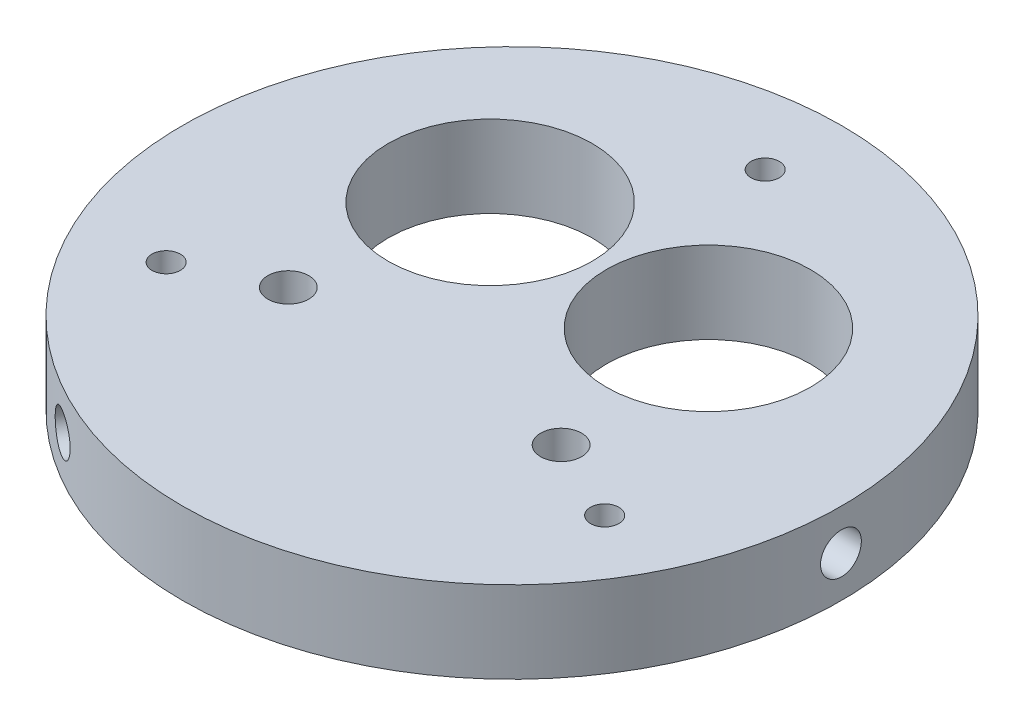
ISO-10303-21;
HEADER;
FILE_DESCRIPTION(('STEP AP214'),'2;1');
FILE_NAME('part.step','',(''),(''),'','','');
FILE_SCHEMA(('AUTOMOTIVE_DESIGN { 1 0 10303 214 1 1 1 1 }'));
ENDSEC;
DATA;
#1=APPLICATION_CONTEXT('core data for automotive mechanical design processes');
#2=APPLICATION_PROTOCOL_DEFINITION('international standard','automotive_design',2000,#1);
#3=PRODUCT_CONTEXT('',#1,'mechanical');
#4=PRODUCT('Part','Part','',(#3));
#5=PRODUCT_RELATED_PRODUCT_CATEGORY('part','',(#4));
#6=PRODUCT_DEFINITION_FORMATION('','',#4);
#7=PRODUCT_DEFINITION_CONTEXT('part definition',#1,'design');
#8=PRODUCT_DEFINITION('design','',#6,#7);
#9=PRODUCT_DEFINITION_SHAPE('','',#8);
#10=(LENGTH_UNIT() NAMED_UNIT(*) SI_UNIT(.MILLI.,.METRE.));
#11=(NAMED_UNIT(*) PLANE_ANGLE_UNIT() SI_UNIT($,.RADIAN.));
#12=(NAMED_UNIT(*) SI_UNIT($,.STERADIAN.) SOLID_ANGLE_UNIT());
#13=UNCERTAINTY_MEASURE_WITH_UNIT(LENGTH_MEASURE(1.E-05),#10,'distance_accuracy_value','');
#14=(GEOMETRIC_REPRESENTATION_CONTEXT(3) GLOBAL_UNCERTAINTY_ASSIGNED_CONTEXT((#13)) GLOBAL_UNIT_ASSIGNED_CONTEXT((#10,
#11,#12)) REPRESENTATION_CONTEXT('',''));
#15=CARTESIAN_POINT('',(0.,0.,0.));
#16=DIRECTION('',(0.,0.,1.));
#17=DIRECTION('',(1.,0.,0.));
#18=AXIS2_PLACEMENT_3D('',#15,#16,#17);
#19=CARTESIAN_POINT('',(0.,9.525,0.));
#20=DIRECTION('',(0.,-1.,0.));
#21=DIRECTION('',(0.,0.,-1.));
#22=AXIS2_PLACEMENT_3D('',#19,#20,#21);
#23=CYLINDRICAL_SURFACE('',#22,38.354);
#24=CARTESIAN_POINT('',(38.2804018525146,4.7625,-2.37489999999974));
#25=CARTESIAN_POINT('',(38.2804028373069,4.62923809089192,-2.37489413527671));
#26=CARTESIAN_POINT('',(38.2811052035353,4.49588281019358,-2.36364579205755));
#27=CARTESIAN_POINT('',(38.2838391152481,4.23285434302784,-2.31893528967399));
#28=CARTESIAN_POINT('',(38.2858722087771,4.10318562870893,-2.28544725825875));
#29=CARTESIAN_POINT('',(38.2910364070698,3.85137838047477,-2.19722280005456));
#30=CARTESIAN_POINT('',(38.2941669331792,3.72923591794559,-2.14249756959386));
#31=CARTESIAN_POINT('',(38.3011725260395,3.49590258604333,-2.01337022650416));
#32=CARTESIAN_POINT('',(38.3050474219797,3.38470921301707,-1.93897262662722));
#33=CARTESIAN_POINT('',(38.313111626275,3.17623409838296,-1.77249177631208));
#34=CARTESIAN_POINT('',(38.3173013377438,3.07897067303234,-1.68038560702491));
#35=CARTESIAN_POINT('',(38.3255193340163,2.90127312255655,-1.48114938271447));
#36=CARTESIAN_POINT('',(38.3295476120886,2.82083969861176,-1.37401870204254));
#37=CARTESIAN_POINT('',(38.3369922882502,2.67902969934687,-1.14767193856118));
#38=CARTESIAN_POINT('',(38.3404082021527,2.617668176002,-1.0284464081496));
#39=CARTESIAN_POINT('',(38.3462390227638,2.51584020554425,-0.781360599533002));
#40=CARTESIAN_POINT('',(38.3486539400257,2.47537353813936,-0.653500412378222));
#41=CARTESIAN_POINT('',(38.3522078864978,2.41653451916251,-0.392950312927358));
#42=CARTESIAN_POINT('',(38.3533485636492,2.39813362823547,-0.260266868395284));
#43=CARTESIAN_POINT('',(38.3542310483331,2.38386036623799,0.00631003831127287));
#44=CARTESIAN_POINT('',(38.3539728713895,2.38798774516191,0.14020348704137));
#45=CARTESIAN_POINT('',(38.3520881155161,2.4186303095414,0.405206350489702));
#46=CARTESIAN_POINT('',(38.3504634131721,2.44511479320974,0.536319330484336));
#47=CARTESIAN_POINT('',(38.3460306871079,2.51967212930872,0.792235044756302));
#48=CARTESIAN_POINT('',(38.3432226564961,2.56774510747139,0.917037742277648));
#49=CARTESIAN_POINT('',(38.3367362172293,2.6841495937017,1.15688876407849));
#50=CARTESIAN_POINT('',(38.3330572109929,2.75249501899231,1.27193031723763));
#51=CARTESIAN_POINT('',(38.32524287678,2.90749419472858,1.48891949069444));
#52=CARTESIAN_POINT('',(38.3211075437668,2.99414814726964,1.59086696643552));
#53=CARTESIAN_POINT('',(38.3128377790859,3.18347799568064,1.77895325879296));
#54=CARTESIAN_POINT('',(38.3087033605807,3.28618053913264,1.865065254496));
#55=CARTESIAN_POINT('',(38.3009084798889,3.50459884614974,2.01882939779021));
#56=CARTESIAN_POINT('',(38.2972480178872,3.62031461479223,2.08648153817884));
#57=CARTESIAN_POINT('',(38.2908143984836,3.8614916273744,2.20140364078515));
#58=CARTESIAN_POINT('',(38.2880412899939,3.98695340805489,2.24867247949551));
#59=CARTESIAN_POINT('',(38.2836968563364,4.24405325203897,2.32146770175652));
#60=CARTESIAN_POINT('',(38.2821255172932,4.37569124401501,2.34699433633738));
#61=CARTESIAN_POINT('',(38.2803644239049,4.64117285013254,2.37554713938441));
#62=CARTESIAN_POINT('',(38.2801723805149,4.77501244030647,2.37861058737654));
#63=CARTESIAN_POINT('',(38.2811855558711,5.04130366654735,2.36224745372679));
#64=CARTESIAN_POINT('',(38.2823907674829,5.17375530969764,2.34282098691761));
#65=CARTESIAN_POINT('',(38.2860605414527,5.43340543759909,2.282060435064));
#66=CARTESIAN_POINT('',(38.2885241171049,5.56060795394907,2.24074351377059));
#67=CARTESIAN_POINT('',(38.2944321528365,5.80627343777458,2.13739227430566));
#68=CARTESIAN_POINT('',(38.297876621647,5.92473632744399,2.07535777171928));
#69=CARTESIAN_POINT('',(38.3053638317819,6.14973108341426,1.93223701715204));
#70=CARTESIAN_POINT('',(38.3094073550205,6.25624703183816,1.85112578277772));
#71=CARTESIAN_POINT('',(38.3176342635313,6.45416396797893,1.67219038274789));
#72=CARTESIAN_POINT('',(38.3218176501481,6.54556481031257,1.57436605635746));
#73=CARTESIAN_POINT('',(38.3298595625683,6.71078288610321,1.36462091887382));
#74=CARTESIAN_POINT('',(38.3337176380872,6.7845759977581,1.25268108721998));
#75=CARTESIAN_POINT('',(38.3406677229239,6.91231883823295,1.01797818211948));
#76=CARTESIAN_POINT('',(38.343759736896,6.96626868761152,0.895215174435104));
#77=CARTESIAN_POINT('',(38.3488271428147,7.05275159763808,0.642439443840433));
#78=CARTESIAN_POINT('',(38.350803331031,7.08529993345883,0.512431963669285));
#79=CARTESIAN_POINT('',(38.3534195842414,7.12810588034382,0.248784802508676));
#80=CARTESIAN_POINT('',(38.3540596620933,7.13836370591669,0.115145156485227));
#81=CARTESIAN_POINT('',(38.3539316119804,7.13629537087301,-0.15173399741554));
#82=CARTESIAN_POINT('',(38.3531658382137,7.12400696553796,-0.284973800674045));
#83=CARTESIAN_POINT('',(38.3503168773641,7.07727325897385,-0.547494398021387));
#84=CARTESIAN_POINT('',(38.3482336879553,7.04282791862838,-0.676775185120456));
#85=CARTESIAN_POINT('',(38.3429840573992,6.9527665950289,-0.927713747359896));
#86=CARTESIAN_POINT('',(38.3398176229976,6.89715074360862,-1.04937156996476));
#87=CARTESIAN_POINT('',(38.3327570505148,6.76633244436232,-1.28162755978392));
#88=CARTESIAN_POINT('',(38.3288629314868,6.69113050934785,-1.39222601645454));
#89=CARTESIAN_POINT('',(38.3207772984907,6.52313545836678,-1.59941512264191));
#90=CARTESIAN_POINT('',(38.316585330344,6.43031510026139,-1.6959836649611));
#91=CARTESIAN_POINT('',(38.3083800523644,6.22975362752857,-1.87220132348133));
#92=CARTESIAN_POINT('',(38.3043667865182,6.1220088658622,-1.95184629201958));
#93=CARTESIAN_POINT('',(38.2969677917123,5.89453587654806,-2.0920138541689));
#94=CARTESIAN_POINT('',(38.2935828385411,5.77479311183602,-2.1525128720298));
#95=CARTESIAN_POINT('',(38.2878336952391,5.52691573865806,-2.25247359450052));
#96=CARTESIAN_POINT('',(38.285468309652,5.39879116220686,-2.29195994955248));
#97=CARTESIAN_POINT('',(38.2826463054199,5.18531841211594,-2.3385067489144));
#98=CARTESIAN_POINT('',(38.2818083941843,5.10135027860589,-2.35213658153649));
#99=CARTESIAN_POINT('',(38.2806858540897,4.9324340875067,-2.3703350709771));
#100=CARTESIAN_POINT('',(38.2804012244762,4.84748603125375,-2.37490374014977));
#101=CARTESIAN_POINT('',(38.2804018525146,4.7625,-2.37489999999974));
#102=B_SPLINE_CURVE_WITH_KNOTS('',3,(#24,#25,#26,#27,#28,#29,#30,#31,#32,#33,#34,#35,#36,#37,
#38,#39,#40,#41,#42,#43,#44,#45,#46,#47,#48,#49,#50,#51,#52,#53,#54,#55,#56,#57,#58,#59,#60,#61,
#62,#63,#64,#65,#66,#67,#68,#69,#70,#71,#72,#73,#74,#75,#76,#77,#78,#79,#80,#81,#82,#83,#84,#85,
#86,#87,#88,#89,#90,#91,#92,#93,#94,#95,#96,#97,#98,#99,#100,#101),.UNSPECIFIED.,.T.,.F.,(4,2,2,
2,2,2,2,2,2,2,2,2,2,2,2,2,2,2,2,2,2,2,2,2,2,2,2,2,2,2,2,2,2,2,2,2,2,2,4),(0.,0.399475476302926,
0.799416493165485,1.1991469454962,1.59878578090996,1.99894536307212,2.39912161357537,
2.7996128949367,3.20009995387938,3.60006847169276,4.00003255089726,4.39944827316248,
4.79886632166716,5.19855921151562,5.59825651353268,5.99862467916022,6.3989930010006,
6.79938338792528,7.19976915197735,7.59949029185473,7.99920939077927,8.39861554288699,
8.79802525035158,9.19796095582233,9.59790050781335,9.99838485314969,10.3988667652857,
10.7990625252291,11.1992544339451,11.5987768041428,11.9982998796691,12.3978204673125,
12.7973305955817,13.1974635662305,13.5976944894359,13.9984163444992,14.3986670613082,
14.6534276439034,14.908187879153),.UNSPECIFIED.);
#103=CARTESIAN_POINT('',(38.2804018525146,4.7625,-2.37489999999974));
#104=VERTEX_POINT('',#103);
#105=EDGE_CURVE('E91',#104,#104,#102,.T.);
#106=ORIENTED_EDGE('',*,*,#105,.T.);
#107=EDGE_LOOP('',(#106));
#108=FACE_BOUND('',#107,.T.);
#109=CARTESIAN_POINT('',(-17.08347719481,4.7625,34.3392504713543));
#110=CARTESIAN_POINT('',(-17.0834827662053,4.62923809089192,34.339248391848));
#111=CARTESIAN_POINT('',(-17.0935753002978,4.49588281019358,34.3342324872349));
#112=CARTESIAN_POINT('',(-17.1336626870343,4.23285434302784,34.3142448730381));
#113=CARTESIAN_POINT('',(-17.1636807197271,4.10318562870893,34.2992615679749));
#114=CARTESIAN_POINT('',(-17.2426674409134,3.85137838047477,34.2596216657845));
#115=CARTESIAN_POINT('',(-17.2916261437751,3.72923591794559,34.2349701656921));
#116=CARTESIAN_POINT('',(-17.4069564996441,3.49590258604333,34.1764735155328));
#117=CARTESIAN_POINT('',(-17.4733241590882,3.38470921301707,34.1426304739156));
#118=CARTESIAN_POINT('',(-17.6215329068524,3.17623409838296,34.066373854539));
#119=CARTESIAN_POINT('',(-17.7033940450348,3.07897067303234,34.023949166462));
#120=CARTESIAN_POINT('',(-17.8800466747779,2.90127312255656,33.9314480478469));
#121=CARTESIAN_POINT('',(-17.9748387048007,2.82083969861176,33.8813712986551));
#122=CARTESIAN_POINT('',(-18.1745830901207,2.67902969934687,33.7746451955933));
#123=CARTESIAN_POINT('',(-18.2795433851881,2.617668176002,33.7179906986042));
#124=CARTESIAN_POINT('',(-18.4964413826702,2.51584020554425,33.59949743307));
#125=CARTESIAN_POINT('',(-18.6083790115098,2.47537353813936,33.5376587191895));
#126=CARTESIAN_POINT('',(-18.8357989898289,2.4165345191625,33.4104614773926));
#127=CARTESIAN_POINT('',(-18.951276562031,2.39813362823547,33.3451076105171));
#128=CARTESIAN_POINT('',(-19.1825801776431,2.38386036623799,33.2125834113186));
#129=CARTESIAN_POINT('',(-19.2984062171719,2.38798774516191,33.1454130991617));
#130=CARTESIAN_POINT('',(-19.5269630510571,2.41863030954139,33.0112794209713));
#131=CARTESIAN_POINT('',(-19.6396978713263,2.44511479320974,32.9443158974704));
#132=CARTESIAN_POINT('',(-19.8591110180814,2.51967212930871,32.8125191869549));
#133=CARTESIAN_POINT('',(-19.9657893092898,2.56774510747139,32.7476860123498));
#134=CARTESIAN_POINT('',(-20.1702631676596,2.6841495937017,32.6221430802642));
#135=CARTESIAN_POINT('',(-20.268052572068,2.7524950189923,32.5614361908232));
#136=CARTESIAN_POINT('',(-20.4520635415213,2.90749419472858,32.4461741921528));
#137=CARTESIAN_POINT('',(-20.5382849788582,2.99414814726964,32.3916191508397));
#138=CARTESIAN_POINT('',(-20.6970376038029,3.18347799568064,32.2904141783639));
#139=CARTESIAN_POINT('',(-20.7695455703997,3.28618053913264,32.2437776690571));
#140=CARTESIAN_POINT('',(-20.8988117843378,3.50459884614974,32.1601450327115));
#141=CARTESIAN_POINT('',(-20.9555700255338,3.62031461479223,32.123148909434));
#142=CARTESIAN_POINT('',(-21.0518786761454,3.8614916273744,32.0601161802891));
#143=CARTESIAN_POINT('',(-21.0914281370312,3.98695340805489,32.0340801785344));
#144=CARTESIAN_POINT('',(-21.1522984319546,4.24405325203896,31.9939201774914));
#145=CARTESIAN_POINT('',(-21.1736194764531,4.37569124401501,31.9797960406716));
#146=CARTESIAN_POINT('',(-21.197466382547,4.64117285013254,31.9639944875354));
#147=CARTESIAN_POINT('',(-21.2000233846363,4.77501244030647,31.962296449085));
#148=CARTESIAN_POINT('',(-21.1863590828882,5.04130366654735,31.9713554515068));
#149=CARTESIAN_POINT('',(-21.1701378749316,5.17375530969764,31.9821124287841));
#150=CARTESIAN_POINT('',(-21.1193525804633,5.43340543759909,32.0156708221949));
#151=CARTESIAN_POINT('',(-21.0848028648431,5.56060795394907,32.0384628019406));
#152=CARTESIAN_POINT('',(-20.9982520838197,5.80627343777458,32.0952549307031));
#153=CARTESIAN_POINT('',(-20.946250863074,5.924736327444,32.1292551794887));
#154=CARTESIAN_POINT('',(-20.8260482588774,6.14973108341426,32.2072996709527));
#155=CARTESIAN_POINT('',(-20.7578256309963,6.25624703183816,32.2513570819853));
#156=CARTESIAN_POINT('',(-20.6069764831895,6.45416396797893,32.3479494937651));
#157=CARTESIAN_POINT('',(-20.5243498247357,6.54556481031257,32.4004845760443));
#158=CARTESIAN_POINT('',(-20.3467261635647,6.71078288610321,32.512321645237));
#159=CARTESIAN_POINT('',(-20.2517124634165,6.7845759977581,32.571632752473));
#160=CARTESIAN_POINT('',(-20.0519288276759,6.91231883823295,32.6950031550504));
#161=CARTESIAN_POINT('',(-19.9471589513623,6.96626868761152,32.7590624215412));
#162=CARTESIAN_POINT('',(-19.7307824501664,7.05275159763808,32.8898387890954));
#163=CARTESIAN_POINT('',(-19.6191807637644,7.08529993345883,32.956553958379));
#164=CARTESIAN_POINT('',(-19.3921637511688,7.12810588034382,33.0906432807022));
#165=CARTESIAN_POINT('',(-19.2767484616857,7.13836370591669,33.1580174273941));
#166=CARTESIAN_POINT('',(-19.0455603096107,7.13629537087301,33.2913461096937));
#167=CARTESIAN_POINT('',(-18.9297883683103,7.12400696553796,33.3573028317875));
#168=CARTESIAN_POINT('',(-18.701014381566,7.07727325897386,33.486095857991));
#169=CARTESIAN_POINT('',(-18.5880123410126,7.04282791862838,33.5489321565916));
#170=CARTESIAN_POINT('',(-18.368068356046,6.9527665950289,33.6698551242893));
#171=CARTESIAN_POINT('',(-18.2611263739003,6.89715074360862,33.7279418229606));
#172=CARTESIAN_POINT('',(-18.0564565002944,6.76633244436232,33.8379551827347));
#173=CARTESIAN_POINT('',(-17.9587283676843,6.69113050934784,33.8898820050665));
#174=CARTESIAN_POINT('',(-17.7752545218406,6.52313545836678,33.9864741945798));
#175=CARTESIAN_POINT('',(-17.6895277269124,6.43031510026139,34.0311281148325));
#176=CARTESIAN_POINT('',(-17.5328161190487,6.22975362752858,34.1121309649172));
#177=CARTESIAN_POINT('',(-17.4618349200879,6.1220088658622,34.1484778590114));
#178=CARTESIAN_POINT('',(-17.336746753077,5.89453587654806,34.2121539226216));
#179=CARTESIAN_POINT('',(-17.2826605901199,5.77479311183602,34.2394719761152));
#180=CARTESIAN_POINT('',(-17.1932174934286,5.52691573865806,34.2844734332011));
#181=CARTESIAN_POINT('',(-17.1578386140572,5.39879116220686,34.3021681267189));
#182=CARTESIAN_POINT('',(-17.1161169012289,5.18531841211594,34.3229975990452));
#183=CARTESIAN_POINT('',(-17.103894164311,5.10135027860589,34.3290868629402));
#184=CARTESIAN_POINT('',(-17.0875725400976,4.9324340875067,34.3372139594217));
#185=CARTESIAN_POINT('',(-17.0834736417259,4.84748603125375,34.3392517975321));
#186=CARTESIAN_POINT('',(-17.08347719481,4.7625,34.3392504713543));
#187=B_SPLINE_CURVE_WITH_KNOTS('',3,(#109,#110,#111,#112,#113,#114,#115,#116,#117,#118,#119,
#120,#121,#122,#123,#124,#125,#126,#127,#128,#129,#130,#131,#132,#133,#134,#135,#136,#137,#138,
#139,#140,#141,#142,#143,#144,#145,#146,#147,#148,#149,#150,#151,#152,#153,#154,#155,#156,#157,
#158,#159,#160,#161,#162,#163,#164,#165,#166,#167,#168,#169,#170,#171,#172,#173,#174,#175,#176,
#177,#178,#179,#180,#181,#182,#183,#184,#185,#186),.UNSPECIFIED.,.T.,.F.,(4,2,2,2,2,2,2,2,2,2,2,
2,2,2,2,2,2,2,2,2,2,2,2,2,2,2,2,2,2,2,2,2,2,2,2,2,2,2,4),(0.,0.399475476302926,
0.799416493165485,1.1991469454962,1.59878578090996,1.99894536307212,2.39912161357536,
2.7996128949367,3.20009995387938,3.60006847169275,4.00003255089726,4.39944827316247,
4.79886632166716,5.19855921151562,5.59825651353268,5.99862467916022,6.3989930010006,
6.79938338792527,7.19976915197735,7.59949029185473,7.99920939077927,8.39861554288699,
8.79802525035157,9.19796095582232,9.59790050781334,9.99838485314969,10.3988667652857,
10.7990625252291,11.1992544339451,11.5987768041428,11.9982998796691,12.3978204673125,
12.7973305955817,13.1974635662305,13.5976944894359,13.9984163444991,14.3986670613082,
14.6534276439034,14.908187879153),.UNSPECIFIED.);
#188=CARTESIAN_POINT('',(-17.08347719481,4.7625,34.3392504713543));
#189=VERTEX_POINT('',#188);
#190=EDGE_CURVE('E92',#189,#189,#187,.T.);
#191=ORIENTED_EDGE('',*,*,#190,.T.);
#192=EDGE_LOOP('',(#191));
#193=FACE_BOUND('',#192,.T.);
#194=CARTESIAN_POINT('',(-21.1969246577049,4.7625,-31.9643504713545));
#195=CARTESIAN_POINT('',(-21.1969200711019,4.62923809089192,-31.9643542565713));
#196=CARTESIAN_POINT('',(-21.1875299032378,4.49588281019358,-31.9705866951773));
#197=CARTESIAN_POINT('',(-21.1501764282141,4.23285434302784,-31.9953095833641));
#198=CARTESIAN_POINT('',(-21.1221914890503,4.10318562870893,-32.0138143097161));
#199=CARTESIAN_POINT('',(-21.0483689661567,3.85137838047477,-32.0623988657299));
#200=CARTESIAN_POINT('',(-21.0025407894044,3.72923591794559,-32.0924725960982));
#201=CARTESIAN_POINT('',(-20.8942160263957,3.49590258604333,-32.1631032890286));
#202=CARTESIAN_POINT('',(-20.8317232628918,3.38470921301707,-32.2036578472883));
#203=CARTESIAN_POINT('',(-20.6915787194229,3.17623409838296,-32.2938820782269));
#204=CARTESIAN_POINT('',(-20.6139072927094,3.07897067303234,-32.3435635594371));
#205=CARTESIAN_POINT('',(-20.4454726592387,2.90127312255655,-32.4502986651325));
#206=CARTESIAN_POINT('',(-20.3547089072882,2.82083969861176,-32.5073525966125));
#207=CARTESIAN_POINT('',(-20.1624091981298,2.67902969934687,-32.6269732570321));
#208=CARTESIAN_POINT('',(-20.0608648169649,2.617668176002,-32.6895442904546));
#209=CARTESIAN_POINT('',(-19.8497976400938,2.51584020554425,-32.818136833537));
#210=CARTESIAN_POINT('',(-19.7402749285161,2.47537353813936,-32.8841583068112));
#211=CARTESIAN_POINT('',(-19.5164088966692,2.41653451916251,-33.0175111644653));
#212=CARTESIAN_POINT('',(-19.4020720016185,2.39813362823547,-33.0848407421218));
#213=CARTESIAN_POINT('',(-19.1716508706903,2.38386036623799,-33.2188934496299));
#214=CARTESIAN_POINT('',(-19.0555666542179,2.38798774516191,-33.2856165862031));
#215=CARTESIAN_POINT('',(-18.8251250644594,2.4186303095414,-33.416485771461));
#216=CARTESIAN_POINT('',(-18.7107655418461,2.44511479320974,-33.4806352279548));
#217=CARTESIAN_POINT('',(-18.4869196690269,2.51967212930872,-33.6047542317112));
#218=CARTESIAN_POINT('',(-18.3774333472066,2.56774510747139,-33.6647237546274));
#219=CARTESIAN_POINT('',(-18.1664730495701,2.6841495937017,-33.7790318443427));
#220=CARTESIAN_POINT('',(-18.0650046389252,2.75249501899231,-33.8333665080608));
#221=CARTESIAN_POINT('',(-17.873179335259,2.90749419472859,-33.9350936828473));
#222=CARTESIAN_POINT('',(-17.7828225649089,2.99414814726964,-33.9824861172752));
#223=CARTESIAN_POINT('',(-17.6158001752833,3.18347799568064,-34.0693674371569));
#224=CARTESIAN_POINT('',(-17.5391577901813,3.28618053913264,-34.1088429235531));
#225=CARTESIAN_POINT('',(-17.4020966955515,3.50459884614974,-34.1789744305017));
#226=CARTESIAN_POINT('',(-17.3416779923536,3.62031461479223,-34.2096304476129));
#227=CARTESIAN_POINT('',(-17.2389357223385,3.8614916273744,-34.2615198210742));
#228=CARTESIAN_POINT('',(-17.1966131529631,3.98695340805489,-34.2827526580299));
#229=CARTESIAN_POINT('',(-17.1313984243821,4.24405325203897,-34.315387879248));
#230=CARTESIAN_POINT('',(-17.1085060408404,4.37569124401501,-34.326790377009));
#231=CARTESIAN_POINT('',(-17.0828980413583,4.64117285013254,-34.3395416269199));
#232=CARTESIAN_POINT('',(-17.0801489958789,4.77501244030647,-34.3409070364615));
#233=CARTESIAN_POINT('',(-17.0948264729832,5.04130366654735,-34.3336029052336));
#234=CARTESIAN_POINT('',(-17.1122528925516,5.17375530969764,-34.3249334157018));
#235=CARTESIAN_POINT('',(-17.1667079609897,5.43340543759909,-34.2977312572589));
#236=CARTESIAN_POINT('',(-17.2037212522621,5.56060795394907,-34.2792063157112));
#237=CARTESIAN_POINT('',(-17.2961800690171,5.80627343777458,-34.2326472050088));
#238=CARTESIAN_POINT('',(-17.3516257585733,5.924736327444,-34.204612951208));
#239=CARTESIAN_POINT('',(-17.4793155729048,6.14973108341426,-34.1395366881047));
#240=CARTESIAN_POINT('',(-17.5515817240246,6.25624703183816,-34.102482864763));
#241=CARTESIAN_POINT('',(-17.7106577803421,6.45416396797893,-34.020139876513));
#242=CARTESIAN_POINT('',(-17.7974678254127,6.54556481031257,-33.9748506324018));
#243=CARTESIAN_POINT('',(-17.9831333990039,6.71078288610321,-33.8769425641109));
#244=CARTESIAN_POINT('',(-18.0820051746709,6.7845759977581,-33.824313839693));
#245=CARTESIAN_POINT('',(-18.2887388952484,6.91231883823295,-33.7129813371698));
#246=CARTESIAN_POINT('',(-18.3966007855341,6.96626868761152,-33.6542775959763));
#247=CARTESIAN_POINT('',(-18.6180446926485,7.05275159763808,-33.5322782329358));
#248=CARTESIAN_POINT('',(-18.7316225672669,7.08529993345883,-33.4689859220483));
#249=CARTESIAN_POINT('',(-18.9612558330728,7.12810588034382,-33.3394280832109));
#250=CARTESIAN_POINT('',(-19.0773112004078,7.13836370591669,-33.2731625838793));
#251=CARTESIAN_POINT('',(-19.30837130237,7.13629537087301,-33.1396121122782));
#252=CARTESIAN_POINT('',(-19.4233774699037,7.12400696553796,-33.0723290311135));
#253=CARTESIAN_POINT('',(-19.6493024957984,7.07727325897385,-32.9386014599696));
#254=CARTESIAN_POINT('',(-19.760221346943,7.04282791862838,-32.8721569714712));
#255=CARTESIAN_POINT('',(-19.9749157013535,6.9527665950289,-32.7421413769294));
#256=CARTESIAN_POINT('',(-20.0786912490976,6.89715074360862,-32.6785702529958));
#257=CARTESIAN_POINT('',(-20.2763005502207,6.76633244436232,-32.5563276229508));
#258=CARTESIAN_POINT('',(-20.3701345638028,6.69113050934785,-32.4976559886119));
#259=CARTESIAN_POINT('',(-20.5455227766504,6.52313545836678,-32.3870590719379));
#260=CARTESIAN_POINT('',(-20.6270576034319,6.43031510026139,-32.3351444498714));
#261=CARTESIAN_POINT('',(-20.775563933316,6.22975362752858,-32.2399296414358));
#262=CARTESIAN_POINT('',(-20.8425318664307,6.1220088658622,-32.1966315669918));
#263=CARTESIAN_POINT('',(-20.9602210386355,5.89453587654807,-32.1201400684527));
#264=CARTESIAN_POINT('',(-21.0109222484215,5.77479311183602,-32.0869591040854));
#265=CARTESIAN_POINT('',(-21.0946162018108,5.52691573865806,-32.0319998387005));
#266=CARTESIAN_POINT('',(-21.1276296955951,5.39879116220686,-32.0102081771664));
#267=CARTESIAN_POINT('',(-21.1665294041913,5.18531841211594,-31.9844908501308));
#268=CARTESIAN_POINT('',(-21.1779142298736,5.10135027860589,-31.9769502814036));
#269=CARTESIAN_POINT('',(-21.1931133139923,4.9324340875067,-31.9668788884446));
#270=CARTESIAN_POINT('',(-21.1969275827506,4.84748603125375,-31.9643480573823));
#271=CARTESIAN_POINT('',(-21.1969246577049,4.7625,-31.9643504713545));
#272=B_SPLINE_CURVE_WITH_KNOTS('',3,(#194,#195,#196,#197,#198,#199,#200,#201,#202,#203,#204,
#205,#206,#207,#208,#209,#210,#211,#212,#213,#214,#215,#216,#217,#218,#219,#220,#221,#222,#223,
#224,#225,#226,#227,#228,#229,#230,#231,#232,#233,#234,#235,#236,#237,#238,#239,#240,#241,#242,
#243,#244,#245,#246,#247,#248,#249,#250,#251,#252,#253,#254,#255,#256,#257,#258,#259,#260,#261,
#262,#263,#264,#265,#266,#267,#268,#269,#270,#271),.UNSPECIFIED.,.T.,.F.,(4,2,2,2,2,2,2,2,2,2,2,
2,2,2,2,2,2,2,2,2,2,2,2,2,2,2,2,2,2,2,2,2,2,2,2,2,2,2,4),(0.,0.399475476302926,
0.799416493165484,1.1991469454962,1.59878578090996,1.99894536307212,2.39912161357536,
2.7996128949367,3.20009995387938,3.60006847169276,4.00003255089726,4.39944827316248,
4.79886632166716,5.19855921151562,5.59825651353268,5.99862467916022,6.3989930010006,
6.79938338792527,7.19976915197735,7.59949029185473,7.99920939077927,8.39861554288699,
8.79802525035157,9.19796095582233,9.59790050781334,9.99838485314968,10.3988667652857,
10.7990625252291,11.1992544339451,11.5987768041428,11.9982998796691,12.3978204673125,
12.7973305955817,13.1974635662305,13.5976944894359,13.9984163444991,14.3986670613082,
14.6534276439034,14.908187879153),.UNSPECIFIED.);
#273=CARTESIAN_POINT('',(-21.1969246577049,4.7625,-31.9643504713545));
#274=VERTEX_POINT('',#273);
#275=EDGE_CURVE('E10',#274,#274,#272,.T.);
#276=ORIENTED_EDGE('',*,*,#275,.T.);
#277=EDGE_LOOP('',(#276));
#278=FACE_BOUND('',#277,.T.);
#279=CARTESIAN_POINT('',(0.,9.525,0.));
#280=DIRECTION('',(0.,1.,0.));
#281=DIRECTION('',(0.,0.,1.));
#282=AXIS2_PLACEMENT_3D('',#279,#280,#281);
#283=CIRCLE('',#282,38.354);
#284=CARTESIAN_POINT('',(0.,9.525,38.354));
#285=VERTEX_POINT('',#284);
#286=EDGE_CURVE('E44',#285,#285,#283,.T.);
#287=ORIENTED_EDGE('',*,*,#286,.F.);
#288=EDGE_LOOP('',(#287));
#289=FACE_BOUND('',#288,.T.);
#290=CARTESIAN_POINT('',(0.,0.,0.));
#291=DIRECTION('',(0.,1.,0.));
#292=DIRECTION('',(0.,0.,1.));
#293=AXIS2_PLACEMENT_3D('',#290,#291,#292);
#294=CIRCLE('',#293,38.354);
#295=CARTESIAN_POINT('',(0.,0.,38.354));
#296=VERTEX_POINT('',#295);
#297=EDGE_CURVE('E48',#296,#296,#294,.T.);
#298=ORIENTED_EDGE('',*,*,#297,.T.);
#299=EDGE_LOOP('',(#298));
#300=FACE_BOUND('',#299,.T.);
#301=ADVANCED_FACE('F33',(#108,#193,#278,#289,#300),#23,.T.);
#302=CARTESIAN_POINT('',(0.,9.525,0.));
#303=DIRECTION('',(0.,1.,0.));
#304=DIRECTION('',(0.,0.,1.));
#305=AXIS2_PLACEMENT_3D('',#302,#303,#304);
#306=PLANE('',#305);
#307=CARTESIAN_POINT('',(-15.875,9.525,10.16));
#308=DIRECTION('',(0.,1.,0.));
#309=DIRECTION('',(0.,0.,1.));
#310=AXIS2_PLACEMENT_3D('',#307,#308,#309);
#311=CIRCLE('',#310,2.38125);
#312=CARTESIAN_POINT('',(-15.875,9.525,12.54125));
#313=VERTEX_POINT('',#312);
#314=EDGE_CURVE('E130',#313,#313,#311,.T.);
#315=ORIENTED_EDGE('',*,*,#314,.F.);
#316=EDGE_LOOP('',(#315));
#317=FACE_BOUND('',#316,.T.);
#318=CARTESIAN_POINT('',(15.875,9.525,10.16));
#319=DIRECTION('',(0.,1.,0.));
#320=DIRECTION('',(0.,0.,1.));
#321=AXIS2_PLACEMENT_3D('',#318,#319,#320);
#322=CIRCLE('',#321,2.38125);
#323=CARTESIAN_POINT('',(15.875,9.525,12.54125));
#324=VERTEX_POINT('',#323);
#325=EDGE_CURVE('E124',#324,#324,#322,.T.);
#326=ORIENTED_EDGE('',*,*,#325,.F.);
#327=EDGE_LOOP('',(#326));
#328=FACE_BOUND('',#327,.T.);
#329=CARTESIAN_POINT('',(0.,9.525,-29.464));
#330=DIRECTION('',(0.,1.,0.));
#331=DIRECTION('',(0.,0.,1.));
#332=AXIS2_PLACEMENT_3D('',#329,#330,#331);
#333=CIRCLE('',#332,1.651);
#334=CARTESIAN_POINT('',(0.,9.525,-27.813));
#335=VERTEX_POINT('',#334);
#336=EDGE_CURVE('E80',#335,#335,#333,.T.);
#337=ORIENTED_EDGE('',*,*,#336,.F.);
#338=EDGE_LOOP('',(#337));
#339=FACE_BOUND('',#338,.T.);
#340=CARTESIAN_POINT('',(-25.5165724971028,9.525,14.7320000000011));
#341=DIRECTION('',(0.,1.,0.));
#342=DIRECTION('',(0.,0.,1.));
#343=AXIS2_PLACEMENT_3D('',#340,#341,#342);
#344=CIRCLE('',#343,1.651);
#345=CARTESIAN_POINT('',(-25.5165724971028,9.525,16.3830000000011));
#346=VERTEX_POINT('',#345);
#347=EDGE_CURVE('E74',#346,#346,#344,.T.);
#348=ORIENTED_EDGE('',*,*,#347,.F.);
#349=EDGE_LOOP('',(#348));
#350=FACE_BOUND('',#349,.T.);
#351=CARTESIAN_POINT('',(-12.7,9.525,-10.16));
#352=DIRECTION('',(0.,1.,0.));
#353=DIRECTION('',(0.,0.,1.));
#354=AXIS2_PLACEMENT_3D('',#351,#352,#353);
#355=CIRCLE('',#354,11.8745);
#356=CARTESIAN_POINT('',(-12.7,9.525,1.7145));
#357=VERTEX_POINT('',#356);
#358=EDGE_CURVE('E68',#357,#357,#355,.T.);
#359=ORIENTED_EDGE('',*,*,#358,.F.);
#360=EDGE_LOOP('',(#359));
#361=FACE_BOUND('',#360,.T.);
#362=CARTESIAN_POINT('',(12.7,9.525,-10.16));
#363=DIRECTION('',(0.,1.,0.));
#364=DIRECTION('',(0.,0.,1.));
#365=AXIS2_PLACEMENT_3D('',#362,#363,#364);
#366=CIRCLE('',#365,11.8745);
#367=CARTESIAN_POINT('',(12.7,9.525,1.7145));
#368=VERTEX_POINT('',#367);
#369=EDGE_CURVE('E62',#368,#368,#366,.T.);
#370=ORIENTED_EDGE('',*,*,#369,.F.);
#371=EDGE_LOOP('',(#370));
#372=FACE_BOUND('',#371,.T.);
#373=CARTESIAN_POINT('',(25.5165724971066,9.525,14.7319999999989));
#374=DIRECTION('',(0.,1.,0.));
#375=DIRECTION('',(0.,0.,1.));
#376=AXIS2_PLACEMENT_3D('',#373,#374,#375);
#377=CIRCLE('',#376,1.651);
#378=CARTESIAN_POINT('',(25.5165724971066,9.525,16.3829999999989));
#379=VERTEX_POINT('',#378);
#380=EDGE_CURVE('E55',#379,#379,#377,.T.);
#381=ORIENTED_EDGE('',*,*,#380,.F.);
#382=EDGE_LOOP('',(#381));
#383=FACE_BOUND('',#382,.T.);
#384=ORIENTED_EDGE('',*,*,#286,.T.);
#385=EDGE_LOOP('',(#384));
#386=FACE_BOUND('',#385,.T.);
#387=ADVANCED_FACE('F146',(#317,#328,#339,#350,#361,#372,#383,#386),#306,.T.);
#388=CARTESIAN_POINT('',(0.,0.,0.));
#389=DIRECTION('',(0.,1.,0.));
#390=DIRECTION('',(0.,0.,1.));
#391=AXIS2_PLACEMENT_3D('',#388,#389,#390);
#392=PLANE('',#391);
#393=CARTESIAN_POINT('',(-15.875,0.,10.16));
#394=DIRECTION('',(0.,1.,0.));
#395=DIRECTION('',(0.,0.,1.));
#396=AXIS2_PLACEMENT_3D('',#393,#394,#395);
#397=CIRCLE('',#396,2.38125);
#398=CARTESIAN_POINT('',(-15.875,0.,12.54125));
#399=VERTEX_POINT('',#398);
#400=EDGE_CURVE('E100',#399,#399,#397,.T.);
#401=ORIENTED_EDGE('',*,*,#400,.T.);
#402=EDGE_LOOP('',(#401));
#403=FACE_BOUND('',#402,.T.);
#404=CARTESIAN_POINT('',(15.875,0.,10.16));
#405=DIRECTION('',(0.,1.,0.));
#406=DIRECTION('',(0.,0.,1.));
#407=AXIS2_PLACEMENT_3D('',#404,#405,#406);
#408=CIRCLE('',#407,2.38125);
#409=CARTESIAN_POINT('',(15.875,0.,12.54125));
#410=VERTEX_POINT('',#409);
#411=EDGE_CURVE('E127',#410,#410,#408,.T.);
#412=ORIENTED_EDGE('',*,*,#411,.T.);
#413=EDGE_LOOP('',(#412));
#414=FACE_BOUND('',#413,.T.);
#415=CARTESIAN_POINT('',(0.,0.,-29.464));
#416=DIRECTION('',(0.,1.,0.));
#417=DIRECTION('',(0.,0.,1.));
#418=AXIS2_PLACEMENT_3D('',#415,#416,#417);
#419=CIRCLE('',#418,1.651);
#420=CARTESIAN_POINT('',(0.,0.,-27.813));
#421=VERTEX_POINT('',#420);
#422=EDGE_CURVE('E53',#421,#421,#419,.T.);
#423=ORIENTED_EDGE('',*,*,#422,.T.);
#424=EDGE_LOOP('',(#423));
#425=FACE_BOUND('',#424,.T.);
#426=CARTESIAN_POINT('',(-25.5165724971028,0.,14.7320000000011));
#427=DIRECTION('',(0.,1.,0.));
#428=DIRECTION('',(0.,0.,1.));
#429=AXIS2_PLACEMENT_3D('',#426,#427,#428);
#430=CIRCLE('',#429,1.651);
#431=CARTESIAN_POINT('',(-25.5165724971028,0.,16.3830000000011));
#432=VERTEX_POINT('',#431);
#433=EDGE_CURVE('E77',#432,#432,#430,.T.);
#434=ORIENTED_EDGE('',*,*,#433,.T.);
#435=EDGE_LOOP('',(#434));
#436=FACE_BOUND('',#435,.T.);
#437=CARTESIAN_POINT('',(-12.7,0.,-10.16));
#438=DIRECTION('',(0.,1.,0.));
#439=DIRECTION('',(0.,0.,1.));
#440=AXIS2_PLACEMENT_3D('',#437,#438,#439);
#441=CIRCLE('',#440,11.8745);
#442=CARTESIAN_POINT('',(-12.7,0.,1.7145));
#443=VERTEX_POINT('',#442);
#444=EDGE_CURVE('E71',#443,#443,#441,.T.);
#445=ORIENTED_EDGE('',*,*,#444,.T.);
#446=EDGE_LOOP('',(#445));
#447=FACE_BOUND('',#446,.T.);
#448=CARTESIAN_POINT('',(12.7,0.,-10.16));
#449=DIRECTION('',(0.,1.,0.));
#450=DIRECTION('',(0.,0.,1.));
#451=AXIS2_PLACEMENT_3D('',#448,#449,#450);
#452=CIRCLE('',#451,11.8745);
#453=CARTESIAN_POINT('',(12.7,0.,1.7145));
#454=VERTEX_POINT('',#453);
#455=EDGE_CURVE('E65',#454,#454,#452,.T.);
#456=ORIENTED_EDGE('',*,*,#455,.T.);
#457=EDGE_LOOP('',(#456));
#458=FACE_BOUND('',#457,.T.);
#459=CARTESIAN_POINT('',(25.5165724971066,0.,14.7319999999989));
#460=DIRECTION('',(0.,1.,0.));
#461=DIRECTION('',(0.,0.,1.));
#462=AXIS2_PLACEMENT_3D('',#459,#460,#461);
#463=CIRCLE('',#462,1.651);
#464=CARTESIAN_POINT('',(25.5165724971066,0.,16.3829999999989));
#465=VERTEX_POINT('',#464);
#466=EDGE_CURVE('E58',#465,#465,#463,.T.);
#467=ORIENTED_EDGE('',*,*,#466,.T.);
#468=EDGE_LOOP('',(#467));
#469=FACE_BOUND('',#468,.T.);
#470=ORIENTED_EDGE('',*,*,#297,.F.);
#471=EDGE_LOOP('',(#470));
#472=FACE_BOUND('',#471,.T.);
#473=ADVANCED_FACE('F136',(#403,#414,#425,#436,#447,#458,#469,#472),#392,.F.);
#474=CARTESIAN_POINT('',(25.5165724971066,0.,14.7319999999989));
#475=DIRECTION('',(0.,1.,0.));
#476=DIRECTION('',(0.,0.,1.));
#477=AXIS2_PLACEMENT_3D('',#474,#475,#476);
#478=CYLINDRICAL_SURFACE('',#477,1.651);
#479=ORIENTED_EDGE('',*,*,#466,.F.);
#480=EDGE_LOOP('',(#479));
#481=FACE_BOUND('',#480,.T.);
#482=ORIENTED_EDGE('',*,*,#380,.T.);
#483=EDGE_LOOP('',(#482));
#484=FACE_BOUND('',#483,.T.);
#485=ADVANCED_FACE('F162',(#481,#484),#478,.F.);
#486=CARTESIAN_POINT('',(12.7,0.,-10.16));
#487=DIRECTION('',(0.,1.,0.));
#488=DIRECTION('',(0.,0.,1.));
#489=AXIS2_PLACEMENT_3D('',#486,#487,#488);
#490=CYLINDRICAL_SURFACE('',#489,11.8745);
#491=ORIENTED_EDGE('',*,*,#455,.F.);
#492=EDGE_LOOP('',(#491));
#493=FACE_BOUND('',#492,.T.);
#494=ORIENTED_EDGE('',*,*,#369,.T.);
#495=EDGE_LOOP('',(#494));
#496=FACE_BOUND('',#495,.T.);
#497=ADVANCED_FACE('F164',(#493,#496),#490,.F.);
#498=CARTESIAN_POINT('',(-12.7,0.,-10.16));
#499=DIRECTION('',(0.,1.,0.));
#500=DIRECTION('',(0.,0.,1.));
#501=AXIS2_PLACEMENT_3D('',#498,#499,#500);
#502=CYLINDRICAL_SURFACE('',#501,11.8745);
#503=ORIENTED_EDGE('',*,*,#444,.F.);
#504=EDGE_LOOP('',(#503));
#505=FACE_BOUND('',#504,.T.);
#506=ORIENTED_EDGE('',*,*,#358,.T.);
#507=EDGE_LOOP('',(#506));
#508=FACE_BOUND('',#507,.T.);
#509=ADVANCED_FACE('F171',(#505,#508),#502,.F.);
#510=CARTESIAN_POINT('',(-25.5165724971028,0.,14.7320000000011));
#511=DIRECTION('',(0.,1.,0.));
#512=DIRECTION('',(0.,0.,1.));
#513=AXIS2_PLACEMENT_3D('',#510,#511,#512);
#514=CYLINDRICAL_SURFACE('',#513,1.651);
#515=ORIENTED_EDGE('',*,*,#433,.F.);
#516=EDGE_LOOP('',(#515));
#517=FACE_BOUND('',#516,.T.);
#518=ORIENTED_EDGE('',*,*,#347,.T.);
#519=EDGE_LOOP('',(#518));
#520=FACE_BOUND('',#519,.T.);
#521=ADVANCED_FACE('F219',(#517,#520),#514,.F.);
#522=CARTESIAN_POINT('',(0.,0.,-29.464));
#523=DIRECTION('',(0.,1.,0.));
#524=DIRECTION('',(0.,0.,1.));
#525=AXIS2_PLACEMENT_3D('',#522,#523,#524);
#526=CYLINDRICAL_SURFACE('',#525,1.651);
#527=ORIENTED_EDGE('',*,*,#422,.F.);
#528=EDGE_LOOP('',(#527));
#529=FACE_BOUND('',#528,.T.);
#530=ORIENTED_EDGE('',*,*,#336,.T.);
#531=EDGE_LOOP('',(#530));
#532=FACE_BOUND('',#531,.T.);
#533=ADVANCED_FACE('F224',(#529,#532),#526,.F.);
#534=CARTESIAN_POINT('',(-16.0019999999999,4.7625,-27.7162770227172));
#535=DIRECTION('',(-0.499999999999998,0.,-0.86602540378444));
#536=DIRECTION('',(-0.86602540378444,0.,0.499999999999998));
#537=AXIS2_PLACEMENT_3D('',#534,#535,#536);
#538=CYLINDRICAL_SURFACE('',#537,2.3749);
#539=CARTESIAN_POINT('',(-16.0019999999999,4.7625,-27.7162770227172));
#540=DIRECTION('',(-0.499999999999998,0.,-0.86602540378444));
#541=DIRECTION('',(-0.86602540378444,0.,0.499999999999998));
#542=AXIS2_PLACEMENT_3D('',#539,#540,#541);
#543=CIRCLE('',#542,2.3749);
#544=CARTESIAN_POINT('',(-18.0587237314476,4.7625,-26.5288270227172));
#545=VERTEX_POINT('',#544);
#546=EDGE_CURVE('E59',#545,#545,#543,.T.);
#547=ORIENTED_EDGE('',*,*,#546,.F.);
#548=EDGE_LOOP('',(#547));
#549=FACE_BOUND('',#548,.T.);
#550=ORIENTED_EDGE('',*,*,#275,.F.);
#551=EDGE_LOOP('',(#550));
#552=FACE_BOUND('',#551,.T.);
#553=ADVANCED_FACE('F229',(#549,#552),#538,.F.);
#554=CARTESIAN_POINT('',(-16.0019999999999,4.7625,-27.7162770227172));
#555=DIRECTION('',(-0.499999999999998,0.,-0.86602540378444));
#556=DIRECTION('',(-0.86602540378444,0.,0.499999999999998));
#557=AXIS2_PLACEMENT_3D('',#554,#555,#556);
#558=PLANE('',#557);
#559=ORIENTED_EDGE('',*,*,#546,.T.);
#560=EDGE_LOOP('',(#559));
#561=FACE_BOUND('',#560,.T.);
#562=ADVANCED_FACE('F109',(#561),#558,.T.);
#563=CARTESIAN_POINT('',(-16.0020000000003,4.7625,27.716277022717));
#564=DIRECTION('',(-0.50000000000001,0.,0.866025403784433));
#565=DIRECTION('',(0.866025403784433,0.,0.50000000000001));
#566=AXIS2_PLACEMENT_3D('',#563,#564,#565);
#567=CYLINDRICAL_SURFACE('',#566,2.3749);
#568=CARTESIAN_POINT('',(-16.0020000000003,4.7625,27.716277022717));
#569=DIRECTION('',(-0.50000000000001,0.,0.866025403784433));
#570=DIRECTION('',(0.866025403784433,0.,0.50000000000001));
#571=AXIS2_PLACEMENT_3D('',#568,#569,#570);
#572=CIRCLE('',#571,2.3749);
#573=CARTESIAN_POINT('',(-13.9452762685527,4.7625,28.903727022717));
#574=VERTEX_POINT('',#573);
#575=EDGE_CURVE('E88',#574,#574,#572,.T.);
#576=ORIENTED_EDGE('',*,*,#575,.F.);
#577=EDGE_LOOP('',(#576));
#578=FACE_BOUND('',#577,.T.);
#579=ORIENTED_EDGE('',*,*,#190,.F.);
#580=EDGE_LOOP('',(#579));
#581=FACE_BOUND('',#580,.T.);
#582=ADVANCED_FACE('F104',(#578,#581),#567,.F.);
#583=CARTESIAN_POINT('',(-16.0020000000003,4.7625,27.716277022717));
#584=DIRECTION('',(-0.50000000000001,0.,0.866025403784433));
#585=DIRECTION('',(0.866025403784433,0.,0.50000000000001));
#586=AXIS2_PLACEMENT_3D('',#583,#584,#585);
#587=PLANE('',#586);
#588=ORIENTED_EDGE('',*,*,#575,.T.);
#589=EDGE_LOOP('',(#588));
#590=FACE_BOUND('',#589,.T.);
#591=ADVANCED_FACE('F108',(#590),#587,.T.);
#592=CARTESIAN_POINT('',(32.004,4.7625,2.22044604925031E-13));
#593=DIRECTION('',(1.,0.,0.));
#594=DIRECTION('',(0.,0.,-1.));
#595=AXIS2_PLACEMENT_3D('',#592,#593,#594);
#596=CYLINDRICAL_SURFACE('',#595,2.3749);
#597=CARTESIAN_POINT('',(32.004,4.7625,2.22044604925031E-13));
#598=DIRECTION('',(1.,0.,0.));
#599=DIRECTION('',(0.,0.,-1.));
#600=AXIS2_PLACEMENT_3D('',#597,#598,#599);
#601=CIRCLE('',#600,2.3749);
#602=CARTESIAN_POINT('',(32.004,4.7625,-2.37489999999978));
#603=VERTEX_POINT('',#602);
#604=EDGE_CURVE('E87',#603,#603,#601,.T.);
#605=ORIENTED_EDGE('',*,*,#604,.F.);
#606=EDGE_LOOP('',(#605));
#607=FACE_BOUND('',#606,.T.);
#608=ORIENTED_EDGE('',*,*,#105,.F.);
#609=EDGE_LOOP('',(#608));
#610=FACE_BOUND('',#609,.T.);
#611=ADVANCED_FACE('F113',(#607,#610),#596,.F.);
#612=CARTESIAN_POINT('',(32.004,4.7625,2.22044604925031E-13));
#613=DIRECTION('',(1.,0.,0.));
#614=DIRECTION('',(0.,0.,-1.));
#615=AXIS2_PLACEMENT_3D('',#612,#613,#614);
#616=PLANE('',#615);
#617=ORIENTED_EDGE('',*,*,#604,.T.);
#618=EDGE_LOOP('',(#617));
#619=FACE_BOUND('',#618,.T.);
#620=ADVANCED_FACE('F189',(#619),#616,.T.);
#621=CARTESIAN_POINT('',(15.875,0.,10.16));
#622=DIRECTION('',(0.,1.,0.));
#623=DIRECTION('',(0.,0.,1.));
#624=AXIS2_PLACEMENT_3D('',#621,#622,#623);
#625=CYLINDRICAL_SURFACE('',#624,2.38125);
#626=ORIENTED_EDGE('',*,*,#411,.F.);
#627=EDGE_LOOP('',(#626));
#628=FACE_BOUND('',#627,.T.);
#629=ORIENTED_EDGE('',*,*,#325,.T.);
#630=EDGE_LOOP('',(#629));
#631=FACE_BOUND('',#630,.T.);
#632=ADVANCED_FACE('F142',(#628,#631),#625,.F.);
#633=CARTESIAN_POINT('',(-15.875,0.,10.16));
#634=DIRECTION('',(0.,1.,0.));
#635=DIRECTION('',(0.,0.,1.));
#636=AXIS2_PLACEMENT_3D('',#633,#634,#635);
#637=CYLINDRICAL_SURFACE('',#636,2.38125);
#638=ORIENTED_EDGE('',*,*,#400,.F.);
#639=EDGE_LOOP('',(#638));
#640=FACE_BOUND('',#639,.T.);
#641=ORIENTED_EDGE('',*,*,#314,.T.);
#642=EDGE_LOOP('',(#641));
#643=FACE_BOUND('',#642,.T.);
#644=ADVANCED_FACE('F139',(#640,#643),#637,.F.);
#645=CLOSED_SHELL('',(#301,#387,#473,#485,#497,#509,#521,#533,#553,#562,#582,#591,#611,#620,
#632,#644));
#646=MANIFOLD_SOLID_BREP('B2',#645);
#647=ADVANCED_BREP_SHAPE_REPRESENTATION('',(#18,#646),#14);
#648=SHAPE_DEFINITION_REPRESENTATION(#9,#647);
ENDSEC;
END-ISO-10303-21;
